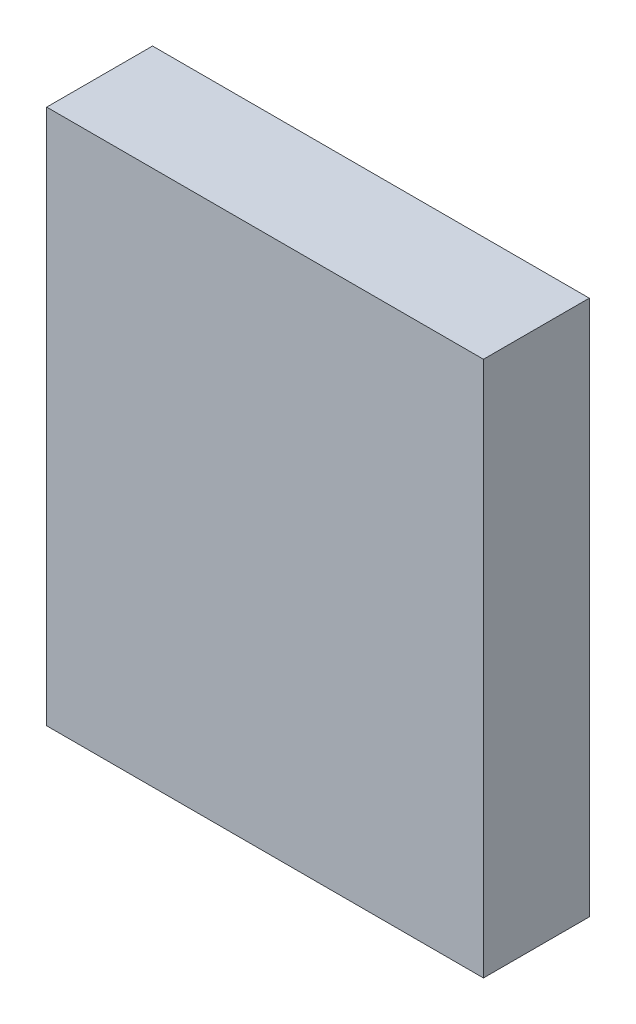
ISO-10303-21;
HEADER;
FILE_DESCRIPTION(('STEP AP214'),'2;1');
FILE_NAME('part.step','',(''),(''),'','','');
FILE_SCHEMA(('AUTOMOTIVE_DESIGN { 1 0 10303 214 1 1 1 1 }'));
ENDSEC;
DATA;
#1=APPLICATION_CONTEXT('core data for automotive mechanical design processes');
#2=APPLICATION_PROTOCOL_DEFINITION('international standard','automotive_design',2000,#1);
#3=PRODUCT_CONTEXT('',#1,'mechanical');
#4=PRODUCT('Part','Part','',(#3));
#5=PRODUCT_RELATED_PRODUCT_CATEGORY('part','',(#4));
#6=PRODUCT_DEFINITION_FORMATION('','',#4);
#7=PRODUCT_DEFINITION_CONTEXT('part definition',#1,'design');
#8=PRODUCT_DEFINITION('design','',#6,#7);
#9=PRODUCT_DEFINITION_SHAPE('','',#8);
#10=(LENGTH_UNIT() NAMED_UNIT(*) SI_UNIT(.MILLI.,.METRE.));
#11=(NAMED_UNIT(*) PLANE_ANGLE_UNIT() SI_UNIT($,.RADIAN.));
#12=(NAMED_UNIT(*) SI_UNIT($,.STERADIAN.) SOLID_ANGLE_UNIT());
#13=UNCERTAINTY_MEASURE_WITH_UNIT(LENGTH_MEASURE(1.E-05),#10,'distance_accuracy_value','');
#14=(GEOMETRIC_REPRESENTATION_CONTEXT(3) GLOBAL_UNCERTAINTY_ASSIGNED_CONTEXT((#13)) GLOBAL_UNIT_ASSIGNED_CONTEXT((#10,
#11,#12)) REPRESENTATION_CONTEXT('',''));
#15=CARTESIAN_POINT('',(0.,0.,0.));
#16=DIRECTION('',(0.,0.,1.));
#17=DIRECTION('',(1.,0.,0.));
#18=AXIS2_PLACEMENT_3D('',#15,#16,#17);
#19=CARTESIAN_POINT('',(-2.0635,-2.5,1.));
#20=DIRECTION('',(1.,0.,0.));
#21=DIRECTION('',(0.,0.,-1.));
#22=AXIS2_PLACEMENT_3D('',#19,#20,#21);
#23=PLANE('',#22);
#24=DIRECTION('',(0.,-1.,0.));
#25=VECTOR('',#24,1.);
#26=CARTESIAN_POINT('',(-2.0635,-2.5,0.));
#27=LINE('',#26,#25);
#28=CARTESIAN_POINT('',(-2.0635,2.5635,0.));
#29=VERTEX_POINT('',#28);
#30=CARTESIAN_POINT('',(-2.0635,-2.5,0.));
#31=VERTEX_POINT('',#30);
#32=EDGE_CURVE('E95',#29,#31,#27,.T.);
#33=ORIENTED_EDGE('',*,*,#32,.T.);
#34=DIRECTION('',(0.,0.,-1.));
#35=VECTOR('',#34,1.);
#36=CARTESIAN_POINT('',(-2.0635,-2.5,1.));
#37=LINE('',#36,#35);
#38=CARTESIAN_POINT('',(-2.0635,-2.5,1.));
#39=VERTEX_POINT('',#38);
#40=EDGE_CURVE('E11',#39,#31,#37,.T.);
#41=ORIENTED_EDGE('',*,*,#40,.F.);
#42=DIRECTION('',(0.,-1.,0.));
#43=VECTOR('',#42,1.);
#44=CARTESIAN_POINT('',(-2.0635,-2.5,1.));
#45=LINE('',#44,#43);
#46=CARTESIAN_POINT('',(-2.0635,2.5635,1.));
#47=VERTEX_POINT('',#46);
#48=EDGE_CURVE('E83',#47,#39,#45,.T.);
#49=ORIENTED_EDGE('',*,*,#48,.F.);
#50=DIRECTION('',(0.,0.,-1.));
#51=VECTOR('',#50,1.);
#52=CARTESIAN_POINT('',(-2.0635,2.5635,1.));
#53=LINE('',#52,#51);
#54=EDGE_CURVE('E91',#47,#29,#53,.T.);
#55=ORIENTED_EDGE('',*,*,#54,.T.);
#56=EDGE_LOOP('',(#33,#41,#49,#55));
#57=FACE_BOUND('',#56,.T.);
#58=ADVANCED_FACE('F32',(#57),#23,.F.);
#59=CARTESIAN_POINT('',(2.0635,-2.5,1.));
#60=DIRECTION('',(0.,1.,0.));
#61=DIRECTION('',(0.,0.,1.));
#62=AXIS2_PLACEMENT_3D('',#59,#60,#61);
#63=PLANE('',#62);
#64=DIRECTION('',(1.,0.,0.));
#65=VECTOR('',#64,1.);
#66=CARTESIAN_POINT('',(2.0635,-2.5,0.));
#67=LINE('',#66,#65);
#68=CARTESIAN_POINT('',(2.0635,-2.5,0.));
#69=VERTEX_POINT('',#68);
#70=EDGE_CURVE('E87',#31,#69,#67,.T.);
#71=ORIENTED_EDGE('',*,*,#70,.T.);
#72=DIRECTION('',(0.,0.,-1.));
#73=VECTOR('',#72,1.);
#74=CARTESIAN_POINT('',(2.0635,-2.5,1.));
#75=LINE('',#74,#73);
#76=CARTESIAN_POINT('',(2.0635,-2.5,1.));
#77=VERTEX_POINT('',#76);
#78=EDGE_CURVE('E40',#77,#69,#75,.T.);
#79=ORIENTED_EDGE('',*,*,#78,.F.);
#80=DIRECTION('',(1.,0.,0.));
#81=VECTOR('',#80,1.);
#82=CARTESIAN_POINT('',(2.0635,-2.5,1.));
#83=LINE('',#82,#81);
#84=EDGE_CURVE('E78',#39,#77,#83,.T.);
#85=ORIENTED_EDGE('',*,*,#84,.F.);
#86=ORIENTED_EDGE('',*,*,#40,.T.);
#87=EDGE_LOOP('',(#71,#79,#85,#86));
#88=FACE_BOUND('',#87,.T.);
#89=ADVANCED_FACE('F86',(#88),#63,.F.);
#90=CARTESIAN_POINT('',(2.0635,2.5635,1.));
#91=DIRECTION('',(-1.,0.,0.));
#92=DIRECTION('',(0.,0.,1.));
#93=AXIS2_PLACEMENT_3D('',#90,#91,#92);
#94=PLANE('',#93);
#95=DIRECTION('',(0.,1.,0.));
#96=VECTOR('',#95,1.);
#97=CARTESIAN_POINT('',(2.0635,2.5635,0.));
#98=LINE('',#97,#96);
#99=CARTESIAN_POINT('',(2.0635,2.5635,0.));
#100=VERTEX_POINT('',#99);
#101=EDGE_CURVE('E65',#69,#100,#98,.T.);
#102=ORIENTED_EDGE('',*,*,#101,.T.);
#103=DIRECTION('',(0.,0.,-1.));
#104=VECTOR('',#103,1.);
#105=CARTESIAN_POINT('',(2.0635,2.5635,1.));
#106=LINE('',#105,#104);
#107=CARTESIAN_POINT('',(2.0635,2.5635,1.));
#108=VERTEX_POINT('',#107);
#109=EDGE_CURVE('E88',#108,#100,#106,.T.);
#110=ORIENTED_EDGE('',*,*,#109,.F.);
#111=DIRECTION('',(0.,1.,0.));
#112=VECTOR('',#111,1.);
#113=CARTESIAN_POINT('',(2.0635,2.5635,1.));
#114=LINE('',#113,#112);
#115=EDGE_CURVE('E81',#77,#108,#114,.T.);
#116=ORIENTED_EDGE('',*,*,#115,.F.);
#117=ORIENTED_EDGE('',*,*,#78,.T.);
#118=EDGE_LOOP('',(#102,#110,#116,#117));
#119=FACE_BOUND('',#118,.T.);
#120=ADVANCED_FACE('F89',(#119),#94,.F.);
#121=CARTESIAN_POINT('',(-2.0635,2.5635,1.));
#122=DIRECTION('',(0.,-1.,0.));
#123=DIRECTION('',(0.,0.,-1.));
#124=AXIS2_PLACEMENT_3D('',#121,#122,#123);
#125=PLANE('',#124);
#126=DIRECTION('',(-1.,0.,0.));
#127=VECTOR('',#126,1.);
#128=CARTESIAN_POINT('',(-2.0635,2.5635,0.));
#129=LINE('',#128,#127);
#130=EDGE_CURVE('E71',#100,#29,#129,.T.);
#131=ORIENTED_EDGE('',*,*,#130,.T.);
#132=ORIENTED_EDGE('',*,*,#54,.F.);
#133=DIRECTION('',(-1.,0.,0.));
#134=VECTOR('',#133,1.);
#135=CARTESIAN_POINT('',(-2.0635,2.5635,1.));
#136=LINE('',#135,#134);
#137=EDGE_CURVE('E48',#108,#47,#136,.T.);
#138=ORIENTED_EDGE('',*,*,#137,.F.);
#139=ORIENTED_EDGE('',*,*,#109,.T.);
#140=EDGE_LOOP('',(#131,#132,#138,#139));
#141=FACE_BOUND('',#140,.T.);
#142=ADVANCED_FACE('F102',(#141),#125,.F.);
#143=CARTESIAN_POINT('',(0.,0.,1.));
#144=DIRECTION('',(0.,0.,-1.));
#145=DIRECTION('',(-1.,0.,0.));
#146=AXIS2_PLACEMENT_3D('',#143,#144,#145);
#147=PLANE('',#146);
#148=ORIENTED_EDGE('',*,*,#48,.T.);
#149=ORIENTED_EDGE('',*,*,#84,.T.);
#150=ORIENTED_EDGE('',*,*,#115,.T.);
#151=ORIENTED_EDGE('',*,*,#137,.T.);
#152=EDGE_LOOP('',(#148,#149,#150,#151));
#153=FACE_BOUND('',#152,.T.);
#154=ADVANCED_FACE('F79',(#153),#147,.F.);
#155=CARTESIAN_POINT('',(0.,0.,0.));
#156=DIRECTION('',(0.,0.,-1.));
#157=DIRECTION('',(-1.,0.,0.));
#158=AXIS2_PLACEMENT_3D('',#155,#156,#157);
#159=PLANE('',#158);
#160=ORIENTED_EDGE('',*,*,#32,.F.);
#161=ORIENTED_EDGE('',*,*,#130,.F.);
#162=ORIENTED_EDGE('',*,*,#101,.F.);
#163=ORIENTED_EDGE('',*,*,#70,.F.);
#164=EDGE_LOOP('',(#160,#161,#162,#163));
#165=FACE_BOUND('',#164,.T.);
#166=ADVANCED_FACE('F105',(#165),#159,.T.);
#167=CLOSED_SHELL('',(#58,#89,#120,#142,#154,#166));
#168=MANIFOLD_SOLID_BREP('B2',#167);
#169=ADVANCED_BREP_SHAPE_REPRESENTATION('',(#18,#168),#14);
#170=SHAPE_DEFINITION_REPRESENTATION(#9,#169);
ENDSEC;
END-ISO-10303-21;
